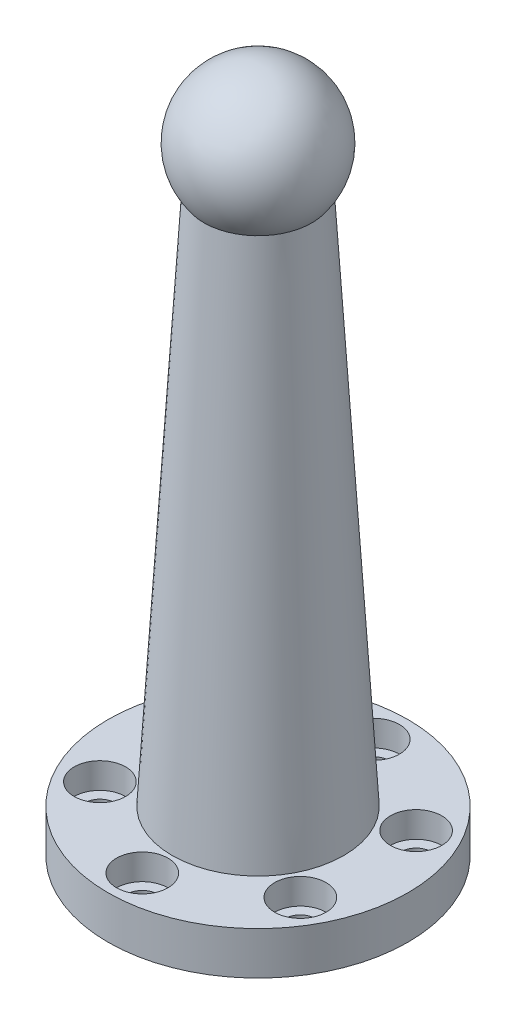
ISO-10303-21;
HEADER;
FILE_DESCRIPTION(('STEP AP214'),'2;1');
FILE_NAME('part.step','',(''),(''),'','','');
FILE_SCHEMA(('AUTOMOTIVE_DESIGN { 1 0 10303 214 1 1 1 1 }'));
ENDSEC;
DATA;
#1=APPLICATION_CONTEXT('core data for automotive mechanical design processes');
#2=APPLICATION_PROTOCOL_DEFINITION('international standard','automotive_design',2000,#1);
#3=PRODUCT_CONTEXT('',#1,'mechanical');
#4=PRODUCT('Part','Part','',(#3));
#5=PRODUCT_RELATED_PRODUCT_CATEGORY('part','',(#4));
#6=PRODUCT_DEFINITION_FORMATION('','',#4);
#7=PRODUCT_DEFINITION_CONTEXT('part definition',#1,'design');
#8=PRODUCT_DEFINITION('design','',#6,#7);
#9=PRODUCT_DEFINITION_SHAPE('','',#8);
#10=(LENGTH_UNIT() NAMED_UNIT(*) SI_UNIT(.MILLI.,.METRE.));
#11=(NAMED_UNIT(*) PLANE_ANGLE_UNIT() SI_UNIT($,.RADIAN.));
#12=(NAMED_UNIT(*) SI_UNIT($,.STERADIAN.) SOLID_ANGLE_UNIT());
#13=UNCERTAINTY_MEASURE_WITH_UNIT(LENGTH_MEASURE(1.E-05),#10,'distance_accuracy_value','');
#14=(GEOMETRIC_REPRESENTATION_CONTEXT(3) GLOBAL_UNCERTAINTY_ASSIGNED_CONTEXT((#13)) GLOBAL_UNIT_ASSIGNED_CONTEXT((#10,
#11,#12)) REPRESENTATION_CONTEXT('',''));
#15=CARTESIAN_POINT('',(0.,0.,0.));
#16=DIRECTION('',(0.,0.,1.));
#17=DIRECTION('',(1.,0.,0.));
#18=AXIS2_PLACEMENT_3D('',#15,#16,#17);
#19=CARTESIAN_POINT('',(0.,72.,0.));
#20=DIRECTION('',(0.,-1.,0.));
#21=DIRECTION('',(0.,0.,-1.));
#22=AXIS2_PLACEMENT_3D('',#19,#20,#21);
#23=CONICAL_SURFACE('',#22,6.,0.0596307131311694);
#24=CARTESIAN_POINT('',(0.,5.,0.));
#25=DIRECTION('',(0.,1.,0.));
#26=DIRECTION('',(0.,0.,1.));
#27=AXIS2_PLACEMENT_3D('',#24,#25,#26);
#28=CIRCLE('',#27,10.);
#29=CARTESIAN_POINT('',(0.,5.,10.));
#30=VERTEX_POINT('',#29);
#31=EDGE_CURVE('E220',#30,#30,#28,.T.);
#32=ORIENTED_EDGE('',*,*,#31,.T.);
#33=EDGE_LOOP('',(#32));
#34=FACE_BOUND('',#33,.T.);
#35=CARTESIAN_POINT('',(0.,67.0627929182528,0.));
#36=DIRECTION('',(0.,1.,0.));
#37=DIRECTION('',(0.,0.,1.));
#38=AXIS2_PLACEMENT_3D('',#35,#36,#37);
#39=CIRCLE('',#38,6.2947586317461);
#40=CARTESIAN_POINT('',(0.,67.0627929182528,6.2947586317461));
#41=VERTEX_POINT('',#40);
#42=EDGE_CURVE('E38',#41,#41,#39,.F.);
#43=ORIENTED_EDGE('',*,*,#42,.T.);
#44=EDGE_LOOP('',(#43));
#45=FACE_BOUND('',#44,.T.);
#46=ADVANCED_FACE('F34',(#34,#45),#23,.T.);
#47=CARTESIAN_POINT('',(0.,5.,0.));
#48=DIRECTION('',(0.,1.,0.));
#49=DIRECTION('',(0.,0.,1.));
#50=AXIS2_PLACEMENT_3D('',#47,#48,#49);
#51=PLANE('',#50);
#52=CARTESIAN_POINT('',(0.,5.,0.));
#53=DIRECTION('',(0.,1.,0.));
#54=DIRECTION('',(0.,0.,1.));
#55=AXIS2_PLACEMENT_3D('',#52,#53,#54);
#56=CIRCLE('',#55,17.5);
#57=CARTESIAN_POINT('',(0.,5.,17.5));
#58=VERTEX_POINT('',#57);
#59=EDGE_CURVE('E11',#58,#58,#56,.T.);
#60=ORIENTED_EDGE('',*,*,#59,.T.);
#61=EDGE_LOOP('',(#60));
#62=FACE_BOUND('',#61,.T.);
#63=CARTESIAN_POINT('',(11.6913429510902,5.,-6.7500000000005));
#64=DIRECTION('',(0.,1.,0.));
#65=DIRECTION('',(0.,0.,1.));
#66=AXIS2_PLACEMENT_3D('',#63,#64,#65);
#67=CIRCLE('',#66,3.00000000000016);
#68=CARTESIAN_POINT('',(11.6913429510902,5.,-3.75000000000034));
#69=VERTEX_POINT('',#68);
#70=EDGE_CURVE('E191',#69,#69,#67,.T.);
#71=ORIENTED_EDGE('',*,*,#70,.F.);
#72=EDGE_LOOP('',(#71));
#73=FACE_BOUND('',#72,.T.);
#74=CARTESIAN_POINT('',(11.6913429510908,5.,6.7499999999995));
#75=DIRECTION('',(0.,1.,0.));
#76=DIRECTION('',(0.,0.,1.));
#77=AXIS2_PLACEMENT_3D('',#74,#75,#76);
#78=CIRCLE('',#77,3.00000000000074);
#79=CARTESIAN_POINT('',(11.6913429510908,5.,9.75000000000024));
#80=VERTEX_POINT('',#79);
#81=EDGE_CURVE('E192',#80,#80,#78,.T.);
#82=ORIENTED_EDGE('',*,*,#81,.F.);
#83=EDGE_LOOP('',(#82));
#84=FACE_BOUND('',#83,.T.);
#85=CARTESIAN_POINT('',(1.14611941239482E-12,5.,13.5));
#86=DIRECTION('',(0.,1.,0.));
#87=DIRECTION('',(0.,0.,1.));
#88=AXIS2_PLACEMENT_3D('',#85,#86,#87);
#89=CIRCLE('',#88,3.00000000000119);
#90=CARTESIAN_POINT('',(1.14611941239482E-12,5.,16.5000000000012));
#91=VERTEX_POINT('',#90);
#92=EDGE_CURVE('E204',#91,#91,#89,.T.);
#93=ORIENTED_EDGE('',*,*,#92,.F.);
#94=EDGE_LOOP('',(#93));
#95=FACE_BOUND('',#94,.T.);
#96=CARTESIAN_POINT('',(-11.6913429510891,5.,6.7500000000005));
#97=DIRECTION('',(0.,1.,0.));
#98=DIRECTION('',(0.,0.,1.));
#99=AXIS2_PLACEMENT_3D('',#96,#97,#98);
#100=CIRCLE('',#99,3.00000000000109);
#101=CARTESIAN_POINT('',(-11.6913429510891,5.,9.75000000000159));
#102=VERTEX_POINT('',#101);
#103=EDGE_CURVE('E81',#102,#102,#100,.T.);
#104=ORIENTED_EDGE('',*,*,#103,.F.);
#105=EDGE_LOOP('',(#104));
#106=FACE_BOUND('',#105,.T.);
#107=CARTESIAN_POINT('',(-11.6913429510896,5.,-6.7499999999995));
#108=DIRECTION('',(0.,1.,0.));
#109=DIRECTION('',(0.,0.,1.));
#110=AXIS2_PLACEMENT_3D('',#107,#108,#109);
#111=CIRCLE('',#110,3.00000000000058);
#112=CARTESIAN_POINT('',(-11.6913429510896,5.,-3.74999999999892));
#113=VERTEX_POINT('',#112);
#114=EDGE_CURVE('E215',#113,#113,#111,.T.);
#115=ORIENTED_EDGE('',*,*,#114,.F.);
#116=EDGE_LOOP('',(#115));
#117=FACE_BOUND('',#116,.T.);
#118=CARTESIAN_POINT('',(0.,5.,-13.5));
#119=DIRECTION('',(0.,1.,0.));
#120=DIRECTION('',(0.,0.,1.));
#121=AXIS2_PLACEMENT_3D('',#118,#119,#120);
#122=CIRCLE('',#121,3.);
#123=CARTESIAN_POINT('',(0.,5.,-10.5));
#124=VERTEX_POINT('',#123);
#125=EDGE_CURVE('E223',#124,#124,#122,.T.);
#126=ORIENTED_EDGE('',*,*,#125,.F.);
#127=EDGE_LOOP('',(#126));
#128=FACE_BOUND('',#127,.T.);
#129=ORIENTED_EDGE('',*,*,#31,.F.);
#130=EDGE_LOOP('',(#129));
#131=FACE_BOUND('',#130,.T.);
#132=ADVANCED_FACE('F100',(#62,#73,#84,#95,#106,#117,#128,#131),#51,.T.);
#133=CARTESIAN_POINT('',(0.,5.,-13.5));
#134=DIRECTION('',(0.,-1.,0.));
#135=DIRECTION('',(0.,0.,-1.));
#136=AXIS2_PLACEMENT_3D('',#133,#134,#135);
#137=CYLINDRICAL_SURFACE('',#136,1.75);
#138=CARTESIAN_POINT('',(0.,0.,-13.5));
#139=DIRECTION('',(0.,1.,0.));
#140=DIRECTION('',(0.,0.,1.));
#141=AXIS2_PLACEMENT_3D('',#138,#139,#140);
#142=CIRCLE('',#141,1.75);
#143=CARTESIAN_POINT('',(0.,0.,-11.75));
#144=VERTEX_POINT('',#143);
#145=EDGE_CURVE('E47',#144,#144,#142,.T.);
#146=ORIENTED_EDGE('',*,*,#145,.F.);
#147=EDGE_LOOP('',(#146));
#148=FACE_BOUND('',#147,.T.);
#149=CARTESIAN_POINT('',(0.,2.,-13.5));
#150=DIRECTION('',(0.,1.,0.));
#151=DIRECTION('',(0.,0.,1.));
#152=AXIS2_PLACEMENT_3D('',#149,#150,#151);
#153=CIRCLE('',#152,1.75);
#154=CARTESIAN_POINT('',(0.,2.,-11.75));
#155=VERTEX_POINT('',#154);
#156=EDGE_CURVE('E67',#155,#155,#153,.T.);
#157=ORIENTED_EDGE('',*,*,#156,.T.);
#158=EDGE_LOOP('',(#157));
#159=FACE_BOUND('',#158,.T.);
#160=ADVANCED_FACE('F97',(#148,#159),#137,.F.);
#161=CARTESIAN_POINT('',(11.6913429510902,5.,-6.7500000000005));
#162=DIRECTION('',(0.,-1.,0.));
#163=DIRECTION('',(0.,0.,-1.));
#164=AXIS2_PLACEMENT_3D('',#161,#162,#163);
#165=CYLINDRICAL_SURFACE('',#164,1.75000000000016);
#166=CARTESIAN_POINT('',(11.6913429510902,0.,-6.7500000000005));
#167=DIRECTION('',(0.,1.,0.));
#168=DIRECTION('',(0.,0.,1.));
#169=AXIS2_PLACEMENT_3D('',#166,#167,#168);
#170=CIRCLE('',#169,1.75000000000016);
#171=CARTESIAN_POINT('',(11.6913429510902,0.,-5.00000000000034));
#172=VERTEX_POINT('',#171);
#173=EDGE_CURVE('E88',#172,#172,#170,.T.);
#174=ORIENTED_EDGE('',*,*,#173,.F.);
#175=EDGE_LOOP('',(#174));
#176=FACE_BOUND('',#175,.T.);
#177=CARTESIAN_POINT('',(11.6913429510902,2.,-6.7500000000005));
#178=DIRECTION('',(0.,1.,0.));
#179=DIRECTION('',(0.,0.,1.));
#180=AXIS2_PLACEMENT_3D('',#177,#178,#179);
#181=CIRCLE('',#180,1.75000000000016);
#182=CARTESIAN_POINT('',(11.6913429510902,2.,-5.00000000000034));
#183=VERTEX_POINT('',#182);
#184=EDGE_CURVE('E65',#183,#183,#181,.T.);
#185=ORIENTED_EDGE('',*,*,#184,.T.);
#186=EDGE_LOOP('',(#185));
#187=FACE_BOUND('',#186,.T.);
#188=ADVANCED_FACE('F99',(#176,#187),#165,.F.);
#189=CARTESIAN_POINT('',(11.6913429510908,5.,6.7499999999995));
#190=DIRECTION('',(0.,-1.,0.));
#191=DIRECTION('',(0.,0.,-1.));
#192=AXIS2_PLACEMENT_3D('',#189,#190,#191);
#193=CYLINDRICAL_SURFACE('',#192,1.75000000000074);
#194=CARTESIAN_POINT('',(11.6913429510908,0.,6.7499999999995));
#195=DIRECTION('',(0.,1.,0.));
#196=DIRECTION('',(0.,0.,1.));
#197=AXIS2_PLACEMENT_3D('',#194,#195,#196);
#198=CIRCLE('',#197,1.75000000000074);
#199=CARTESIAN_POINT('',(11.6913429510908,0.,8.50000000000024));
#200=VERTEX_POINT('',#199);
#201=EDGE_CURVE('E86',#200,#200,#198,.T.);
#202=ORIENTED_EDGE('',*,*,#201,.F.);
#203=EDGE_LOOP('',(#202));
#204=FACE_BOUND('',#203,.T.);
#205=CARTESIAN_POINT('',(11.6913429510908,2.,6.7499999999995));
#206=DIRECTION('',(0.,1.,0.));
#207=DIRECTION('',(0.,0.,1.));
#208=AXIS2_PLACEMENT_3D('',#205,#206,#207);
#209=CIRCLE('',#208,1.75000000000074);
#210=CARTESIAN_POINT('',(11.6913429510908,2.,8.50000000000024));
#211=VERTEX_POINT('',#210);
#212=EDGE_CURVE('E62',#211,#211,#209,.T.);
#213=ORIENTED_EDGE('',*,*,#212,.T.);
#214=EDGE_LOOP('',(#213));
#215=FACE_BOUND('',#214,.T.);
#216=ADVANCED_FACE('F106',(#204,#215),#193,.F.);
#217=CARTESIAN_POINT('',(1.14611941239482E-12,5.,13.5));
#218=DIRECTION('',(0.,-1.,0.));
#219=DIRECTION('',(0.,0.,-1.));
#220=AXIS2_PLACEMENT_3D('',#217,#218,#219);
#221=CYLINDRICAL_SURFACE('',#220,1.75000000000119);
#222=CARTESIAN_POINT('',(1.14611941239482E-12,0.,13.5));
#223=DIRECTION('',(0.,1.,0.));
#224=DIRECTION('',(0.,0.,1.));
#225=AXIS2_PLACEMENT_3D('',#222,#223,#224);
#226=CIRCLE('',#225,1.75000000000119);
#227=CARTESIAN_POINT('',(1.14611941239482E-12,0.,15.2500000000012));
#228=VERTEX_POINT('',#227);
#229=EDGE_CURVE('E78',#228,#228,#226,.T.);
#230=ORIENTED_EDGE('',*,*,#229,.F.);
#231=EDGE_LOOP('',(#230));
#232=FACE_BOUND('',#231,.T.);
#233=CARTESIAN_POINT('',(1.14611941239482E-12,2.,13.5));
#234=DIRECTION('',(0.,1.,0.));
#235=DIRECTION('',(0.,0.,1.));
#236=AXIS2_PLACEMENT_3D('',#233,#234,#235);
#237=CIRCLE('',#236,1.75000000000119);
#238=CARTESIAN_POINT('',(1.14611941239482E-12,2.,15.2500000000012));
#239=VERTEX_POINT('',#238);
#240=EDGE_CURVE('E59',#239,#239,#237,.T.);
#241=ORIENTED_EDGE('',*,*,#240,.T.);
#242=EDGE_LOOP('',(#241));
#243=FACE_BOUND('',#242,.T.);
#244=ADVANCED_FACE('F175',(#232,#243),#221,.F.);
#245=CARTESIAN_POINT('',(-11.6913429510891,5.,6.7500000000005));
#246=DIRECTION('',(0.,-1.,0.));
#247=DIRECTION('',(0.,0.,-1.));
#248=AXIS2_PLACEMENT_3D('',#245,#246,#247);
#249=CYLINDRICAL_SURFACE('',#248,1.75000000000109);
#250=CARTESIAN_POINT('',(-11.6913429510891,0.,6.7500000000005));
#251=DIRECTION('',(0.,1.,0.));
#252=DIRECTION('',(0.,0.,1.));
#253=AXIS2_PLACEMENT_3D('',#250,#251,#252);
#254=CIRCLE('',#253,1.75000000000109);
#255=CARTESIAN_POINT('',(-11.6913429510891,0.,8.50000000000159));
#256=VERTEX_POINT('',#255);
#257=EDGE_CURVE('E73',#256,#256,#254,.T.);
#258=ORIENTED_EDGE('',*,*,#257,.F.);
#259=EDGE_LOOP('',(#258));
#260=FACE_BOUND('',#259,.T.);
#261=CARTESIAN_POINT('',(-11.6913429510891,2.,6.7500000000005));
#262=DIRECTION('',(0.,1.,0.));
#263=DIRECTION('',(0.,0.,1.));
#264=AXIS2_PLACEMENT_3D('',#261,#262,#263);
#265=CIRCLE('',#264,1.75000000000109);
#266=CARTESIAN_POINT('',(-11.6913429510891,2.,8.50000000000159));
#267=VERTEX_POINT('',#266);
#268=EDGE_CURVE('E55',#267,#267,#265,.T.);
#269=ORIENTED_EDGE('',*,*,#268,.T.);
#270=EDGE_LOOP('',(#269));
#271=FACE_BOUND('',#270,.T.);
#272=ADVANCED_FACE('F171',(#260,#271),#249,.F.);
#273=CARTESIAN_POINT('',(-11.6913429510896,5.,-6.7499999999995));
#274=DIRECTION('',(0.,-1.,0.));
#275=DIRECTION('',(0.,0.,-1.));
#276=AXIS2_PLACEMENT_3D('',#273,#274,#275);
#277=CYLINDRICAL_SURFACE('',#276,1.75000000000058);
#278=CARTESIAN_POINT('',(-11.6913429510896,0.,-6.7499999999995));
#279=DIRECTION('',(0.,1.,0.));
#280=DIRECTION('',(0.,0.,1.));
#281=AXIS2_PLACEMENT_3D('',#278,#279,#280);
#282=CIRCLE('',#281,1.75000000000058);
#283=CARTESIAN_POINT('',(-11.6913429510896,0.,-4.99999999999892));
#284=VERTEX_POINT('',#283);
#285=EDGE_CURVE('E69',#284,#284,#282,.T.);
#286=ORIENTED_EDGE('',*,*,#285,.F.);
#287=EDGE_LOOP('',(#286));
#288=FACE_BOUND('',#287,.T.);
#289=CARTESIAN_POINT('',(-11.6913429510896,2.,-6.7499999999995));
#290=DIRECTION('',(0.,1.,0.));
#291=DIRECTION('',(0.,0.,1.));
#292=AXIS2_PLACEMENT_3D('',#289,#290,#291);
#293=CIRCLE('',#292,1.75000000000058);
#294=CARTESIAN_POINT('',(-11.6913429510896,2.,-4.99999999999892));
#295=VERTEX_POINT('',#294);
#296=EDGE_CURVE('E52',#295,#295,#293,.T.);
#297=ORIENTED_EDGE('',*,*,#296,.T.);
#298=EDGE_LOOP('',(#297));
#299=FACE_BOUND('',#298,.T.);
#300=ADVANCED_FACE('F168',(#288,#299),#277,.F.);
#301=CARTESIAN_POINT('',(0.,0.,0.));
#302=DIRECTION('',(0.,1.,0.));
#303=DIRECTION('',(0.,0.,1.));
#304=AXIS2_PLACEMENT_3D('',#301,#302,#303);
#305=PLANE('',#304);
#306=CARTESIAN_POINT('',(0.,0.,0.));
#307=DIRECTION('',(0.,1.,0.));
#308=DIRECTION('',(0.,0.,1.));
#309=AXIS2_PLACEMENT_3D('',#306,#307,#308);
#310=CIRCLE('',#309,17.5);
#311=CARTESIAN_POINT('',(0.,0.,17.5));
#312=VERTEX_POINT('',#311);
#313=EDGE_CURVE('E42',#312,#312,#310,.T.);
#314=ORIENTED_EDGE('',*,*,#313,.F.);
#315=EDGE_LOOP('',(#314));
#316=FACE_BOUND('',#315,.T.);
#317=ORIENTED_EDGE('',*,*,#145,.T.);
#318=EDGE_LOOP('',(#317));
#319=FACE_BOUND('',#318,.T.);
#320=ORIENTED_EDGE('',*,*,#173,.T.);
#321=EDGE_LOOP('',(#320));
#322=FACE_BOUND('',#321,.T.);
#323=ORIENTED_EDGE('',*,*,#201,.T.);
#324=EDGE_LOOP('',(#323));
#325=FACE_BOUND('',#324,.T.);
#326=ORIENTED_EDGE('',*,*,#229,.T.);
#327=EDGE_LOOP('',(#326));
#328=FACE_BOUND('',#327,.T.);
#329=ORIENTED_EDGE('',*,*,#257,.T.);
#330=EDGE_LOOP('',(#329));
#331=FACE_BOUND('',#330,.T.);
#332=ORIENTED_EDGE('',*,*,#285,.T.);
#333=EDGE_LOOP('',(#332));
#334=FACE_BOUND('',#333,.T.);
#335=ADVANCED_FACE('F95',(#316,#319,#322,#325,#328,#331,#334),#305,.F.);
#336=CARTESIAN_POINT('',(0.,5.,0.));
#337=DIRECTION('',(0.,-1.,0.));
#338=DIRECTION('',(0.,0.,-1.));
#339=AXIS2_PLACEMENT_3D('',#336,#337,#338);
#340=CYLINDRICAL_SURFACE('',#339,17.5);
#341=ORIENTED_EDGE('',*,*,#59,.F.);
#342=EDGE_LOOP('',(#341));
#343=FACE_BOUND('',#342,.T.);
#344=ORIENTED_EDGE('',*,*,#313,.T.);
#345=EDGE_LOOP('',(#344));
#346=FACE_BOUND('',#345,.T.);
#347=ADVANCED_FACE('F36',(#343,#346),#340,.T.);
#348=CARTESIAN_POINT('',(-11.6913429510896,2.,-6.7499999999995));
#349=DIRECTION('',(0.,1.,0.));
#350=DIRECTION('',(0.,0.,1.));
#351=AXIS2_PLACEMENT_3D('',#348,#349,#350);
#352=CYLINDRICAL_SURFACE('',#351,3.00000000000058);
#353=CARTESIAN_POINT('',(-11.6913429510896,2.,-6.7499999999995));
#354=DIRECTION('',(0.,1.,0.));
#355=DIRECTION('',(0.,0.,1.));
#356=AXIS2_PLACEMENT_3D('',#353,#354,#355);
#357=CIRCLE('',#356,3.00000000000058);
#358=CARTESIAN_POINT('',(-11.6913429510896,2.,-3.74999999999892));
#359=VERTEX_POINT('',#358);
#360=EDGE_CURVE('E211',#359,#359,#357,.T.);
#361=ORIENTED_EDGE('',*,*,#360,.F.);
#362=EDGE_LOOP('',(#361));
#363=FACE_BOUND('',#362,.T.);
#364=ORIENTED_EDGE('',*,*,#114,.T.);
#365=EDGE_LOOP('',(#364));
#366=FACE_BOUND('',#365,.T.);
#367=ADVANCED_FACE('F133',(#363,#366),#352,.F.);
#368=CARTESIAN_POINT('',(-11.6913429510896,2.,-6.7499999999995));
#369=DIRECTION('',(0.,1.,0.));
#370=DIRECTION('',(0.,0.,1.));
#371=AXIS2_PLACEMENT_3D('',#368,#369,#370);
#372=PLANE('',#371);
#373=ORIENTED_EDGE('',*,*,#296,.F.);
#374=EDGE_LOOP('',(#373));
#375=FACE_BOUND('',#374,.T.);
#376=ORIENTED_EDGE('',*,*,#360,.T.);
#377=EDGE_LOOP('',(#376));
#378=FACE_BOUND('',#377,.T.);
#379=ADVANCED_FACE('F129',(#375,#378),#372,.T.);
#380=CARTESIAN_POINT('',(-11.6913429510891,2.,6.7500000000005));
#381=DIRECTION('',(0.,1.,0.));
#382=DIRECTION('',(0.,0.,1.));
#383=AXIS2_PLACEMENT_3D('',#380,#381,#382);
#384=CYLINDRICAL_SURFACE('',#383,3.00000000000109);
#385=CARTESIAN_POINT('',(-11.6913429510891,2.,6.7500000000005));
#386=DIRECTION('',(0.,1.,0.));
#387=DIRECTION('',(0.,0.,1.));
#388=AXIS2_PLACEMENT_3D('',#385,#386,#387);
#389=CIRCLE('',#388,3.00000000000109);
#390=CARTESIAN_POINT('',(-11.6913429510891,2.,9.75000000000159));
#391=VERTEX_POINT('',#390);
#392=EDGE_CURVE('E206',#391,#391,#389,.T.);
#393=ORIENTED_EDGE('',*,*,#392,.F.);
#394=EDGE_LOOP('',(#393));
#395=FACE_BOUND('',#394,.T.);
#396=ORIENTED_EDGE('',*,*,#103,.T.);
#397=EDGE_LOOP('',(#396));
#398=FACE_BOUND('',#397,.T.);
#399=ADVANCED_FACE('F132',(#395,#398),#384,.F.);
#400=CARTESIAN_POINT('',(-11.6913429510891,2.,6.7500000000005));
#401=DIRECTION('',(0.,1.,0.));
#402=DIRECTION('',(0.,0.,1.));
#403=AXIS2_PLACEMENT_3D('',#400,#401,#402);
#404=PLANE('',#403);
#405=ORIENTED_EDGE('',*,*,#268,.F.);
#406=EDGE_LOOP('',(#405));
#407=FACE_BOUND('',#406,.T.);
#408=ORIENTED_EDGE('',*,*,#392,.T.);
#409=EDGE_LOOP('',(#408));
#410=FACE_BOUND('',#409,.T.);
#411=ADVANCED_FACE('F160',(#407,#410),#404,.T.);
#412=CARTESIAN_POINT('',(1.14611941239482E-12,2.,13.5));
#413=DIRECTION('',(0.,1.,0.));
#414=DIRECTION('',(0.,0.,1.));
#415=AXIS2_PLACEMENT_3D('',#412,#413,#414);
#416=CYLINDRICAL_SURFACE('',#415,3.00000000000119);
#417=CARTESIAN_POINT('',(1.14611941239482E-12,2.,13.5));
#418=DIRECTION('',(0.,1.,0.));
#419=DIRECTION('',(0.,0.,1.));
#420=AXIS2_PLACEMENT_3D('',#417,#418,#419);
#421=CIRCLE('',#420,3.00000000000119);
#422=CARTESIAN_POINT('',(1.14611941239482E-12,2.,16.5000000000012));
#423=VERTEX_POINT('',#422);
#424=EDGE_CURVE('E198',#423,#423,#421,.T.);
#425=ORIENTED_EDGE('',*,*,#424,.F.);
#426=EDGE_LOOP('',(#425));
#427=FACE_BOUND('',#426,.T.);
#428=ORIENTED_EDGE('',*,*,#92,.T.);
#429=EDGE_LOOP('',(#428));
#430=FACE_BOUND('',#429,.T.);
#431=ADVANCED_FACE('F156',(#427,#430),#416,.F.);
#432=CARTESIAN_POINT('',(1.14611941239482E-12,2.,13.5));
#433=DIRECTION('',(0.,1.,0.));
#434=DIRECTION('',(0.,0.,1.));
#435=AXIS2_PLACEMENT_3D('',#432,#433,#434);
#436=PLANE('',#435);
#437=ORIENTED_EDGE('',*,*,#240,.F.);
#438=EDGE_LOOP('',(#437));
#439=FACE_BOUND('',#438,.T.);
#440=ORIENTED_EDGE('',*,*,#424,.T.);
#441=EDGE_LOOP('',(#440));
#442=FACE_BOUND('',#441,.T.);
#443=ADVANCED_FACE('F152',(#439,#442),#436,.T.);
#444=CARTESIAN_POINT('',(11.6913429510908,2.,6.7499999999995));
#445=DIRECTION('',(0.,1.,0.));
#446=DIRECTION('',(0.,0.,1.));
#447=AXIS2_PLACEMENT_3D('',#444,#445,#446);
#448=CYLINDRICAL_SURFACE('',#447,3.00000000000074);
#449=CARTESIAN_POINT('',(11.6913429510908,2.,6.7499999999995));
#450=DIRECTION('',(0.,1.,0.));
#451=DIRECTION('',(0.,0.,1.));
#452=AXIS2_PLACEMENT_3D('',#449,#450,#451);
#453=CIRCLE('',#452,3.00000000000074);
#454=CARTESIAN_POINT('',(11.6913429510908,2.,9.75000000000024));
#455=VERTEX_POINT('',#454);
#456=EDGE_CURVE('E190',#455,#455,#453,.T.);
#457=ORIENTED_EDGE('',*,*,#456,.F.);
#458=EDGE_LOOP('',(#457));
#459=FACE_BOUND('',#458,.T.);
#460=ORIENTED_EDGE('',*,*,#81,.T.);
#461=EDGE_LOOP('',(#460));
#462=FACE_BOUND('',#461,.T.);
#463=ADVANCED_FACE('F148',(#459,#462),#448,.F.);
#464=CARTESIAN_POINT('',(11.6913429510908,2.,6.7499999999995));
#465=DIRECTION('',(0.,1.,0.));
#466=DIRECTION('',(0.,0.,1.));
#467=AXIS2_PLACEMENT_3D('',#464,#465,#466);
#468=PLANE('',#467);
#469=ORIENTED_EDGE('',*,*,#212,.F.);
#470=EDGE_LOOP('',(#469));
#471=FACE_BOUND('',#470,.T.);
#472=ORIENTED_EDGE('',*,*,#456,.T.);
#473=EDGE_LOOP('',(#472));
#474=FACE_BOUND('',#473,.T.);
#475=ADVANCED_FACE('F144',(#471,#474),#468,.T.);
#476=CARTESIAN_POINT('',(11.6913429510902,2.,-6.7500000000005));
#477=DIRECTION('',(0.,1.,0.));
#478=DIRECTION('',(0.,0.,1.));
#479=AXIS2_PLACEMENT_3D('',#476,#477,#478);
#480=CYLINDRICAL_SURFACE('',#479,3.00000000000016);
#481=CARTESIAN_POINT('',(11.6913429510902,2.,-6.7500000000005));
#482=DIRECTION('',(0.,1.,0.));
#483=DIRECTION('',(0.,0.,1.));
#484=AXIS2_PLACEMENT_3D('',#481,#482,#483);
#485=CIRCLE('',#484,3.00000000000016);
#486=CARTESIAN_POINT('',(11.6913429510902,2.,-3.75000000000034));
#487=VERTEX_POINT('',#486);
#488=EDGE_CURVE('E195',#487,#487,#485,.T.);
#489=ORIENTED_EDGE('',*,*,#488,.F.);
#490=EDGE_LOOP('',(#489));
#491=FACE_BOUND('',#490,.T.);
#492=ORIENTED_EDGE('',*,*,#70,.T.);
#493=EDGE_LOOP('',(#492));
#494=FACE_BOUND('',#493,.T.);
#495=ADVANCED_FACE('F140',(#491,#494),#480,.F.);
#496=CARTESIAN_POINT('',(11.6913429510902,2.,-6.7500000000005));
#497=DIRECTION('',(0.,1.,0.));
#498=DIRECTION('',(0.,0.,1.));
#499=AXIS2_PLACEMENT_3D('',#496,#497,#498);
#500=PLANE('',#499);
#501=ORIENTED_EDGE('',*,*,#184,.F.);
#502=EDGE_LOOP('',(#501));
#503=FACE_BOUND('',#502,.T.);
#504=ORIENTED_EDGE('',*,*,#488,.T.);
#505=EDGE_LOOP('',(#504));
#506=FACE_BOUND('',#505,.T.);
#507=ADVANCED_FACE('F127',(#503,#506),#500,.T.);
#508=CARTESIAN_POINT('',(0.,2.,-13.5));
#509=DIRECTION('',(0.,1.,0.));
#510=DIRECTION('',(0.,0.,1.));
#511=AXIS2_PLACEMENT_3D('',#508,#509,#510);
#512=CYLINDRICAL_SURFACE('',#511,3.);
#513=CARTESIAN_POINT('',(0.,2.,-13.5));
#514=DIRECTION('',(0.,1.,0.));
#515=DIRECTION('',(0.,0.,1.));
#516=AXIS2_PLACEMENT_3D('',#513,#514,#515);
#517=CIRCLE('',#516,3.);
#518=CARTESIAN_POINT('',(0.,2.,-10.5));
#519=VERTEX_POINT('',#518);
#520=EDGE_CURVE('E56',#519,#519,#517,.T.);
#521=ORIENTED_EDGE('',*,*,#520,.F.);
#522=EDGE_LOOP('',(#521));
#523=FACE_BOUND('',#522,.T.);
#524=ORIENTED_EDGE('',*,*,#125,.T.);
#525=EDGE_LOOP('',(#524));
#526=FACE_BOUND('',#525,.T.);
#527=ADVANCED_FACE('F123',(#523,#526),#512,.F.);
#528=CARTESIAN_POINT('',(0.,2.,-13.5));
#529=DIRECTION('',(0.,1.,0.));
#530=DIRECTION('',(0.,0.,1.));
#531=AXIS2_PLACEMENT_3D('',#528,#529,#530);
#532=PLANE('',#531);
#533=ORIENTED_EDGE('',*,*,#156,.F.);
#534=EDGE_LOOP('',(#533));
#535=FACE_BOUND('',#534,.T.);
#536=ORIENTED_EDGE('',*,*,#520,.T.);
#537=EDGE_LOOP('',(#536));
#538=FACE_BOUND('',#537,.T.);
#539=ADVANCED_FACE('F120',(#535,#538),#532,.T.);
#540=CARTESIAN_POINT('',(0.,72.,0.));
#541=DIRECTION('',(-1.,0.,0.));
#542=DIRECTION('',(0.,0.,-1.));
#543=AXIS2_PLACEMENT_3D('',#540,#541,#542);
#544=SPHERICAL_SURFACE('',#543,8.);
#545=CARTESIAN_POINT('',(0.,72.,0.));
#546=DIRECTION('',(0.,1.,0.));
#547=DIRECTION('',(0.,0.,1.));
#548=AXIS2_PLACEMENT_3D('',#545,#546,#547);
#549=SPHERICAL_SURFACE('',#548,8.);
#550=ORIENTED_EDGE('',*,*,#42,.F.);
#551=EDGE_LOOP('',(#550));
#552=FACE_BOUND('',#551,.T.);
#553=ADVANCED_FACE('F119',(#552),#549,.T.);
#554=CLOSED_SHELL('',(#46,#132,#160,#188,#216,#244,#272,#300,#335,#347,#367,#379,#399,#411,#431,
#443,#463,#475,#495,#507,#527,#539,#553));
#555=MANIFOLD_SOLID_BREP('B2',#554);
#556=ADVANCED_BREP_SHAPE_REPRESENTATION('',(#18,#555),#14);
#557=SHAPE_DEFINITION_REPRESENTATION(#9,#556);
ENDSEC;
END-ISO-10303-21;
